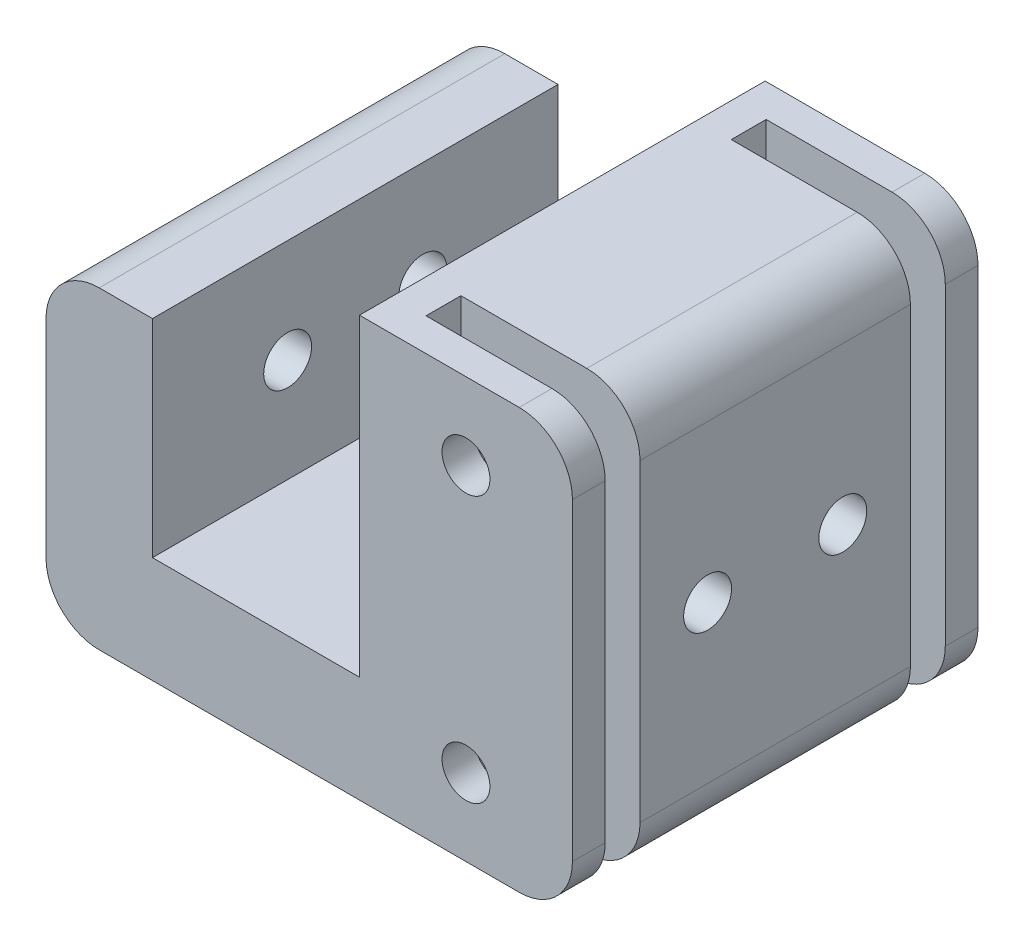
ISO-10303-21;
HEADER;
FILE_DESCRIPTION(('STEP AP214'),'2;1');
FILE_NAME('part.step','',(''),(''),'','','');
FILE_SCHEMA(('AUTOMOTIVE_DESIGN { 1 0 10303 214 1 1 1 1 }'));
ENDSEC;
DATA;
#1=APPLICATION_CONTEXT('core data for automotive mechanical design processes');
#2=APPLICATION_PROTOCOL_DEFINITION('international standard','automotive_design',2000,#1);
#3=PRODUCT_CONTEXT('',#1,'mechanical');
#4=PRODUCT('Part','Part','',(#3));
#5=PRODUCT_RELATED_PRODUCT_CATEGORY('part','',(#4));
#6=PRODUCT_DEFINITION_FORMATION('','',#4);
#7=PRODUCT_DEFINITION_CONTEXT('part definition',#1,'design');
#8=PRODUCT_DEFINITION('design','',#6,#7);
#9=PRODUCT_DEFINITION_SHAPE('','',#8);
#10=(LENGTH_UNIT() NAMED_UNIT(*) SI_UNIT(.MILLI.,.METRE.));
#11=(NAMED_UNIT(*) PLANE_ANGLE_UNIT() SI_UNIT($,.RADIAN.));
#12=(NAMED_UNIT(*) SI_UNIT($,.STERADIAN.) SOLID_ANGLE_UNIT());
#13=UNCERTAINTY_MEASURE_WITH_UNIT(LENGTH_MEASURE(1.E-05),#10,'distance_accuracy_value','');
#14=(GEOMETRIC_REPRESENTATION_CONTEXT(3) GLOBAL_UNCERTAINTY_ASSIGNED_CONTEXT((#13)) GLOBAL_UNIT_ASSIGNED_CONTEXT((#10,
#11,#12)) REPRESENTATION_CONTEXT('',''));
#15=CARTESIAN_POINT('',(0.,0.,0.));
#16=DIRECTION('',(0.,0.,1.));
#17=DIRECTION('',(1.,0.,0.));
#18=AXIS2_PLACEMENT_3D('',#15,#16,#17);
#19=CARTESIAN_POINT('',(24.725,-14.725,19.05));
#20=DIRECTION('',(0.,0.,-1.));
#21=DIRECTION('',(-1.,0.,0.));
#22=AXIS2_PLACEMENT_3D('',#19,#20,#21);
#23=CYLINDRICAL_SURFACE('',#22,5.);
#24=DIRECTION('',(0.,0.,-1.));
#25=VECTOR('',#24,1.);
#26=CARTESIAN_POINT('',(24.725,-19.725,19.05));
#27=LINE('',#26,#25);
#28=CARTESIAN_POINT('',(24.725,-19.725,12.7));
#29=VERTEX_POINT('',#28);
#30=CARTESIAN_POINT('',(24.725,-19.725,-12.7));
#31=VERTEX_POINT('',#30);
#32=EDGE_CURVE('E389',#29,#31,#27,.T.);
#33=ORIENTED_EDGE('',*,*,#32,.T.);
#34=CARTESIAN_POINT('',(24.725,-14.725,-12.7));
#35=DIRECTION('',(0.,0.,1.));
#36=DIRECTION('',(1.,0.,0.));
#37=AXIS2_PLACEMENT_3D('',#34,#35,#36);
#38=CIRCLE('',#37,5.);
#39=CARTESIAN_POINT('',(29.725,-14.725,-12.7));
#40=VERTEX_POINT('',#39);
#41=EDGE_CURVE('E298',#31,#40,#38,.T.);
#42=ORIENTED_EDGE('',*,*,#41,.T.);
#43=DIRECTION('',(0.,0.,-1.));
#44=VECTOR('',#43,1.);
#45=CARTESIAN_POINT('',(29.725,-14.725,19.05));
#46=LINE('',#45,#44);
#47=CARTESIAN_POINT('',(29.725,-14.725,12.7));
#48=VERTEX_POINT('',#47);
#49=EDGE_CURVE('E384',#48,#40,#46,.T.);
#50=ORIENTED_EDGE('',*,*,#49,.F.);
#51=CARTESIAN_POINT('',(24.725,-14.725,12.7));
#52=DIRECTION('',(0.,0.,-1.));
#53=DIRECTION('',(-1.,0.,0.));
#54=AXIS2_PLACEMENT_3D('',#51,#52,#53);
#55=CIRCLE('',#54,5.);
#56=EDGE_CURVE('E271',#48,#29,#55,.T.);
#57=ORIENTED_EDGE('',*,*,#56,.T.);
#58=EDGE_LOOP('',(#33,#42,#50,#57));
#59=FACE_BOUND('',#58,.T.);
#60=ADVANCED_FACE('F41',(#59),#23,.T.);
#61=CARTESIAN_POINT('',(24.725,-19.725,19.05));
#62=VERTEX_POINT('',#61);
#63=CARTESIAN_POINT('',(24.725,-19.725,15.975));
#64=VERTEX_POINT('',#63);
#65=EDGE_CURVE('E385',#62,#64,#27,.T.);
#66=ORIENTED_EDGE('',*,*,#65,.T.);
#67=CARTESIAN_POINT('',(24.725,-14.725,15.975));
#68=DIRECTION('',(0.,0.,1.));
#69=DIRECTION('',(1.,0.,0.));
#70=AXIS2_PLACEMENT_3D('',#67,#68,#69);
#71=CIRCLE('',#70,5.);
#72=CARTESIAN_POINT('',(29.725,-14.725,15.975));
#73=VERTEX_POINT('',#72);
#74=EDGE_CURVE('E281',#64,#73,#71,.T.);
#75=ORIENTED_EDGE('',*,*,#74,.T.);
#76=CARTESIAN_POINT('',(29.725,-14.725,19.05));
#77=VERTEX_POINT('',#76);
#78=EDGE_CURVE('E380',#77,#73,#46,.T.);
#79=ORIENTED_EDGE('',*,*,#78,.F.);
#80=CARTESIAN_POINT('',(24.725,-14.725,19.05));
#81=DIRECTION('',(0.,0.,1.));
#82=DIRECTION('',(1.,0.,0.));
#83=AXIS2_PLACEMENT_3D('',#80,#81,#82);
#84=CIRCLE('',#83,5.);
#85=EDGE_CURVE('E331',#62,#77,#84,.T.);
#86=ORIENTED_EDGE('',*,*,#85,.F.);
#87=EDGE_LOOP('',(#66,#75,#79,#86));
#88=FACE_BOUND('',#87,.T.);
#89=ADVANCED_FACE('F440',(#88),#23,.T.);
#90=CARTESIAN_POINT('',(29.725,-14.725,19.05));
#91=DIRECTION('',(-1.,0.,0.));
#92=DIRECTION('',(0.,0.,1.));
#93=AXIS2_PLACEMENT_3D('',#90,#91,#92);
#94=PLANE('',#93);
#95=CARTESIAN_POINT('',(29.725,0.,6.35));
#96=DIRECTION('',(1.,0.,0.));
#97=DIRECTION('',(0.,0.,-1.));
#98=AXIS2_PLACEMENT_3D('',#95,#96,#97);
#99=CIRCLE('',#98,2.25);
#100=CARTESIAN_POINT('',(29.725,0.,4.1));
#101=VERTEX_POINT('',#100);
#102=EDGE_CURVE('E722',#101,#101,#99,.T.);
#103=ORIENTED_EDGE('',*,*,#102,.F.);
#104=EDGE_LOOP('',(#103));
#105=FACE_BOUND('',#104,.T.);
#106=CARTESIAN_POINT('',(29.725,0.,-6.35));
#107=DIRECTION('',(1.,0.,0.));
#108=DIRECTION('',(0.,0.,-1.));
#109=AXIS2_PLACEMENT_3D('',#106,#107,#108);
#110=CIRCLE('',#109,2.25);
#111=CARTESIAN_POINT('',(29.725,0.,-8.6));
#112=VERTEX_POINT('',#111);
#113=EDGE_CURVE('E736',#112,#112,#110,.T.);
#114=ORIENTED_EDGE('',*,*,#113,.F.);
#115=EDGE_LOOP('',(#114));
#116=FACE_BOUND('',#115,.T.);
#117=ORIENTED_EDGE('',*,*,#49,.T.);
#118=DIRECTION('',(0.,1.,0.));
#119=VECTOR('',#118,1.);
#120=CARTESIAN_POINT('',(29.725,-19.725,-12.7));
#121=LINE('',#120,#119);
#122=CARTESIAN_POINT('',(29.725,14.725,-12.7));
#123=VERTEX_POINT('',#122);
#124=EDGE_CURVE('E235',#40,#123,#121,.T.);
#125=ORIENTED_EDGE('',*,*,#124,.T.);
#126=DIRECTION('',(0.,0.,-1.));
#127=VECTOR('',#126,1.);
#128=CARTESIAN_POINT('',(29.725,14.725,19.05));
#129=LINE('',#128,#127);
#130=CARTESIAN_POINT('',(29.725,14.725,12.7));
#131=VERTEX_POINT('',#130);
#132=EDGE_CURVE('E379',#131,#123,#129,.T.);
#133=ORIENTED_EDGE('',*,*,#132,.F.);
#134=DIRECTION('',(0.,1.,0.));
#135=VECTOR('',#134,1.);
#136=CARTESIAN_POINT('',(29.725,-19.725,12.7));
#137=LINE('',#136,#135);
#138=EDGE_CURVE('E241',#48,#131,#137,.T.);
#139=ORIENTED_EDGE('',*,*,#138,.F.);
#140=EDGE_LOOP('',(#117,#125,#133,#139));
#141=FACE_BOUND('',#140,.T.);
#142=ADVANCED_FACE('F448',(#105,#116,#141),#94,.F.);
#143=ORIENTED_EDGE('',*,*,#78,.T.);
#144=DIRECTION('',(0.,1.,0.));
#145=VECTOR('',#144,1.);
#146=CARTESIAN_POINT('',(29.725,-19.725,15.975));
#147=LINE('',#146,#145);
#148=CARTESIAN_POINT('',(29.725,14.725,15.975));
#149=VERTEX_POINT('',#148);
#150=EDGE_CURVE('E249',#73,#149,#147,.T.);
#151=ORIENTED_EDGE('',*,*,#150,.T.);
#152=CARTESIAN_POINT('',(29.725,14.725,19.05));
#153=VERTEX_POINT('',#152);
#154=EDGE_CURVE('E375',#153,#149,#129,.T.);
#155=ORIENTED_EDGE('',*,*,#154,.F.);
#156=DIRECTION('',(0.,1.,0.));
#157=VECTOR('',#156,1.);
#158=CARTESIAN_POINT('',(29.725,-14.725,19.05));
#159=LINE('',#158,#157);
#160=EDGE_CURVE('E333',#77,#153,#159,.T.);
#161=ORIENTED_EDGE('',*,*,#160,.F.);
#162=EDGE_LOOP('',(#143,#151,#155,#161));
#163=FACE_BOUND('',#162,.T.);
#164=ADVANCED_FACE('F463',(#163),#94,.F.);
#165=CARTESIAN_POINT('',(24.725,14.725,19.05));
#166=DIRECTION('',(0.,0.,-1.));
#167=DIRECTION('',(-1.,0.,0.));
#168=AXIS2_PLACEMENT_3D('',#165,#166,#167);
#169=CYLINDRICAL_SURFACE('',#168,5.);
#170=ORIENTED_EDGE('',*,*,#132,.T.);
#171=CARTESIAN_POINT('',(24.725,14.725,-12.7));
#172=DIRECTION('',(0.,0.,1.));
#173=DIRECTION('',(1.,0.,0.));
#174=AXIS2_PLACEMENT_3D('',#171,#172,#173);
#175=CIRCLE('',#174,5.);
#176=CARTESIAN_POINT('',(24.725,19.725,-12.7));
#177=VERTEX_POINT('',#176);
#178=EDGE_CURVE('E295',#123,#177,#175,.T.);
#179=ORIENTED_EDGE('',*,*,#178,.T.);
#180=DIRECTION('',(0.,0.,-1.));
#181=VECTOR('',#180,1.);
#182=CARTESIAN_POINT('',(24.725,19.725,19.05));
#183=LINE('',#182,#181);
#184=CARTESIAN_POINT('',(24.725,19.725,12.7));
#185=VERTEX_POINT('',#184);
#186=EDGE_CURVE('E374',#185,#177,#183,.T.);
#187=ORIENTED_EDGE('',*,*,#186,.F.);
#188=CARTESIAN_POINT('',(24.725,14.725,12.7));
#189=DIRECTION('',(0.,0.,-1.));
#190=DIRECTION('',(-1.,0.,0.));
#191=AXIS2_PLACEMENT_3D('',#188,#189,#190);
#192=CIRCLE('',#191,5.);
#193=EDGE_CURVE('E66',#185,#131,#192,.T.);
#194=ORIENTED_EDGE('',*,*,#193,.T.);
#195=EDGE_LOOP('',(#170,#179,#187,#194));
#196=FACE_BOUND('',#195,.T.);
#197=ADVANCED_FACE('F485',(#196),#169,.T.);
#198=ORIENTED_EDGE('',*,*,#154,.T.);
#199=CARTESIAN_POINT('',(24.725,14.725,15.975));
#200=DIRECTION('',(0.,0.,1.));
#201=DIRECTION('',(1.,0.,0.));
#202=AXIS2_PLACEMENT_3D('',#199,#200,#201);
#203=CIRCLE('',#202,5.);
#204=CARTESIAN_POINT('',(24.725,19.725,15.975));
#205=VERTEX_POINT('',#204);
#206=EDGE_CURVE('E278',#149,#205,#203,.T.);
#207=ORIENTED_EDGE('',*,*,#206,.T.);
#208=CARTESIAN_POINT('',(24.725,19.725,19.05));
#209=VERTEX_POINT('',#208);
#210=EDGE_CURVE('E370',#209,#205,#183,.T.);
#211=ORIENTED_EDGE('',*,*,#210,.F.);
#212=CARTESIAN_POINT('',(24.725,14.725,19.05));
#213=DIRECTION('',(0.,0.,1.));
#214=DIRECTION('',(-1.,0.,0.));
#215=AXIS2_PLACEMENT_3D('',#212,#213,#214);
#216=CIRCLE('',#215,5.);
#217=EDGE_CURVE('E335',#153,#209,#216,.T.);
#218=ORIENTED_EDGE('',*,*,#217,.F.);
#219=EDGE_LOOP('',(#198,#207,#211,#218));
#220=FACE_BOUND('',#219,.T.);
#221=ADVANCED_FACE('F506',(#220),#169,.T.);
#222=CARTESIAN_POINT('',(19.725,12.5,19.05));
#223=DIRECTION('',(0.,0.,-1.));
#224=DIRECTION('',(-1.,0.,0.));
#225=AXIS2_PLACEMENT_3D('',#222,#223,#224);
#226=CYLINDRICAL_SURFACE('',#225,2.25);
#227=CARTESIAN_POINT('',(19.725,12.5,15.975));
#228=DIRECTION('',(0.,0.,1.));
#229=DIRECTION('',(1.,0.,0.));
#230=AXIS2_PLACEMENT_3D('',#227,#228,#229);
#231=CIRCLE('',#230,2.25);
#232=CARTESIAN_POINT('',(21.975,12.5,15.975));
#233=VERTEX_POINT('',#232);
#234=EDGE_CURVE('E275',#233,#233,#231,.T.);
#235=ORIENTED_EDGE('',*,*,#234,.F.);
#236=EDGE_LOOP('',(#235));
#237=FACE_BOUND('',#236,.T.);
#238=CARTESIAN_POINT('',(19.725,12.5,19.05));
#239=DIRECTION('',(0.,0.,1.));
#240=DIRECTION('',(1.,0.,0.));
#241=AXIS2_PLACEMENT_3D('',#238,#239,#240);
#242=CIRCLE('',#241,2.25);
#243=CARTESIAN_POINT('',(21.975,12.5,19.05));
#244=VERTEX_POINT('',#243);
#245=EDGE_CURVE('E308',#244,#244,#242,.T.);
#246=ORIENTED_EDGE('',*,*,#245,.T.);
#247=EDGE_LOOP('',(#246));
#248=FACE_BOUND('',#247,.T.);
#249=ADVANCED_FACE('F537',(#237,#248),#226,.F.);
#250=CARTESIAN_POINT('',(19.725,-12.5,19.05));
#251=DIRECTION('',(0.,0.,-1.));
#252=DIRECTION('',(-1.,0.,0.));
#253=AXIS2_PLACEMENT_3D('',#250,#251,#252);
#254=CYLINDRICAL_SURFACE('',#253,2.25);
#255=CARTESIAN_POINT('',(19.725,-12.5,15.975));
#256=DIRECTION('',(0.,0.,1.));
#257=DIRECTION('',(1.,0.,0.));
#258=AXIS2_PLACEMENT_3D('',#255,#256,#257);
#259=CIRCLE('',#258,2.25);
#260=CARTESIAN_POINT('',(21.975,-12.5,15.975));
#261=VERTEX_POINT('',#260);
#262=EDGE_CURVE('E274',#261,#261,#259,.T.);
#263=ORIENTED_EDGE('',*,*,#262,.F.);
#264=EDGE_LOOP('',(#263));
#265=FACE_BOUND('',#264,.T.);
#266=CARTESIAN_POINT('',(19.725,-12.5,19.05));
#267=DIRECTION('',(0.,0.,1.));
#268=DIRECTION('',(1.,0.,0.));
#269=AXIS2_PLACEMENT_3D('',#266,#267,#268);
#270=CIRCLE('',#269,2.25);
#271=CARTESIAN_POINT('',(21.975,-12.5,19.05));
#272=VERTEX_POINT('',#271);
#273=EDGE_CURVE('E302',#272,#272,#270,.T.);
#274=ORIENTED_EDGE('',*,*,#273,.T.);
#275=EDGE_LOOP('',(#274));
#276=FACE_BOUND('',#275,.T.);
#277=ADVANCED_FACE('F420',(#265,#276),#254,.F.);
#278=CARTESIAN_POINT('',(24.725,14.725,19.05));
#279=DIRECTION('',(0.,0.,-1.));
#280=DIRECTION('',(-1.,0.,0.));
#281=AXIS2_PLACEMENT_3D('',#278,#279,#280);
#282=PLANE('',#281);
#283=DIRECTION('',(0.,-1.,0.));
#284=VECTOR('',#283,1.);
#285=CARTESIAN_POINT('',(9.725,9.725,19.05));
#286=LINE('',#285,#284);
#287=CARTESIAN_POINT('',(9.725,19.725,19.05));
#288=VERTEX_POINT('',#287);
#289=CARTESIAN_POINT('',(9.725,-9.725,19.05));
#290=VERTEX_POINT('',#289);
#291=EDGE_CURVE('E314',#288,#290,#286,.T.);
#292=ORIENTED_EDGE('',*,*,#291,.T.);
#293=DIRECTION('',(-1.,0.,0.));
#294=VECTOR('',#293,1.);
#295=CARTESIAN_POINT('',(-9.725,-9.725,19.05));
#296=LINE('',#295,#294);
#297=CARTESIAN_POINT('',(-9.725,-9.725,19.05));
#298=VERTEX_POINT('',#297);
#299=EDGE_CURVE('E316',#290,#298,#296,.T.);
#300=ORIENTED_EDGE('',*,*,#299,.T.);
#301=DIRECTION('',(0.,1.,0.));
#302=VECTOR('',#301,1.);
#303=CARTESIAN_POINT('',(-9.725,-9.725,19.05));
#304=LINE('',#303,#302);
#305=CARTESIAN_POINT('',(-9.725,9.725,19.05));
#306=VERTEX_POINT('',#305);
#307=EDGE_CURVE('E319',#298,#306,#304,.T.);
#308=ORIENTED_EDGE('',*,*,#307,.T.);
#309=DIRECTION('',(-1.,0.,0.));
#310=VECTOR('',#309,1.);
#311=CARTESIAN_POINT('',(-9.725,9.725,19.05));
#312=LINE('',#311,#310);
#313=CARTESIAN_POINT('',(-14.725,9.725,19.05));
#314=VERTEX_POINT('',#313);
#315=EDGE_CURVE('E321',#306,#314,#312,.T.);
#316=ORIENTED_EDGE('',*,*,#315,.T.);
#317=CARTESIAN_POINT('',(-14.725,4.725,19.05));
#318=DIRECTION('',(0.,0.,1.));
#319=DIRECTION('',(1.,0.,0.));
#320=AXIS2_PLACEMENT_3D('',#317,#318,#319);
#321=CIRCLE('',#320,5.);
#322=CARTESIAN_POINT('',(-19.725,4.725,19.05));
#323=VERTEX_POINT('',#322);
#324=EDGE_CURVE('E323',#314,#323,#321,.T.);
#325=ORIENTED_EDGE('',*,*,#324,.T.);
#326=DIRECTION('',(0.,-1.,0.));
#327=VECTOR('',#326,1.);
#328=CARTESIAN_POINT('',(-19.725,4.725,19.05));
#329=LINE('',#328,#327);
#330=CARTESIAN_POINT('',(-19.725,-14.725,19.05));
#331=VERTEX_POINT('',#330);
#332=EDGE_CURVE('E325',#323,#331,#329,.T.);
#333=ORIENTED_EDGE('',*,*,#332,.T.);
#334=CARTESIAN_POINT('',(-14.725,-14.725,19.05));
#335=DIRECTION('',(0.,0.,1.));
#336=DIRECTION('',(1.,0.,0.));
#337=AXIS2_PLACEMENT_3D('',#334,#335,#336);
#338=CIRCLE('',#337,5.);
#339=CARTESIAN_POINT('',(-14.725,-19.725,19.05));
#340=VERTEX_POINT('',#339);
#341=EDGE_CURVE('E327',#331,#340,#338,.T.);
#342=ORIENTED_EDGE('',*,*,#341,.T.);
#343=DIRECTION('',(1.,0.,0.));
#344=VECTOR('',#343,1.);
#345=CARTESIAN_POINT('',(-14.725,-19.725,19.05));
#346=LINE('',#345,#344);
#347=EDGE_CURVE('E329',#340,#62,#346,.T.);
#348=ORIENTED_EDGE('',*,*,#347,.T.);
#349=ORIENTED_EDGE('',*,*,#85,.T.);
#350=ORIENTED_EDGE('',*,*,#160,.T.);
#351=ORIENTED_EDGE('',*,*,#217,.T.);
#352=DIRECTION('',(-1.,0.,0.));
#353=VECTOR('',#352,1.);
#354=CARTESIAN_POINT('',(9.725,19.725,19.05));
#355=LINE('',#354,#353);
#356=EDGE_CURVE('E337',#209,#288,#355,.T.);
#357=ORIENTED_EDGE('',*,*,#356,.T.);
#358=EDGE_LOOP('',(#292,#300,#308,#316,#325,#333,#342,#348,#349,#350,#351,#357));
#359=FACE_BOUND('',#358,.T.);
#360=ORIENTED_EDGE('',*,*,#245,.F.);
#361=EDGE_LOOP('',(#360));
#362=FACE_BOUND('',#361,.T.);
#363=ORIENTED_EDGE('',*,*,#273,.F.);
#364=EDGE_LOOP('',(#363));
#365=FACE_BOUND('',#364,.T.);
#366=ADVANCED_FACE('F425',(#359,#362,#365),#282,.F.);
#367=CARTESIAN_POINT('',(24.725,14.725,-19.05));
#368=DIRECTION('',(0.,0.,-1.));
#369=DIRECTION('',(-1.,0.,0.));
#370=AXIS2_PLACEMENT_3D('',#367,#368,#369);
#371=PLANE('',#370);
#372=CARTESIAN_POINT('',(19.725,12.5,-19.05));
#373=DIRECTION('',(0.,0.,1.));
#374=DIRECTION('',(1.,0.,0.));
#375=AXIS2_PLACEMENT_3D('',#372,#373,#374);
#376=CIRCLE('',#375,2.25);
#377=CARTESIAN_POINT('',(21.975,12.5,-19.05));
#378=VERTEX_POINT('',#377);
#379=EDGE_CURVE('E305',#378,#378,#376,.T.);
#380=ORIENTED_EDGE('',*,*,#379,.T.);
#381=EDGE_LOOP('',(#380));
#382=FACE_BOUND('',#381,.T.);
#383=DIRECTION('',(0.,-1.,0.));
#384=VECTOR('',#383,1.);
#385=CARTESIAN_POINT('',(9.725,-9.725,-19.05));
#386=LINE('',#385,#384);
#387=CARTESIAN_POINT('',(9.725,19.725,-19.05));
#388=VERTEX_POINT('',#387);
#389=CARTESIAN_POINT('',(9.725,-9.725,-19.05));
#390=VERTEX_POINT('',#389);
#391=EDGE_CURVE('E311',#388,#390,#386,.T.);
#392=ORIENTED_EDGE('',*,*,#391,.F.);
#393=DIRECTION('',(-1.,0.,0.));
#394=VECTOR('',#393,1.);
#395=CARTESIAN_POINT('',(9.725,19.725,-19.05));
#396=LINE('',#395,#394);
#397=CARTESIAN_POINT('',(24.725,19.725,-19.05));
#398=VERTEX_POINT('',#397);
#399=EDGE_CURVE('E317',#398,#388,#396,.T.);
#400=ORIENTED_EDGE('',*,*,#399,.F.);
#401=CARTESIAN_POINT('',(24.725,14.725,-19.05));
#402=DIRECTION('',(0.,0.,1.));
#403=DIRECTION('',(-1.,0.,0.));
#404=AXIS2_PLACEMENT_3D('',#401,#402,#403);
#405=CIRCLE('',#404,5.);
#406=CARTESIAN_POINT('',(29.725,14.725,-19.05));
#407=VERTEX_POINT('',#406);
#408=EDGE_CURVE('E362',#407,#398,#405,.T.);
#409=ORIENTED_EDGE('',*,*,#408,.F.);
#410=DIRECTION('',(0.,1.,0.));
#411=VECTOR('',#410,1.);
#412=CARTESIAN_POINT('',(29.725,-14.725,-19.05));
#413=LINE('',#412,#411);
#414=CARTESIAN_POINT('',(29.725,-14.725,-19.05));
#415=VERTEX_POINT('',#414);
#416=EDGE_CURVE('E359',#415,#407,#413,.T.);
#417=ORIENTED_EDGE('',*,*,#416,.F.);
#418=CARTESIAN_POINT('',(24.725,-14.725,-19.05));
#419=DIRECTION('',(0.,0.,1.));
#420=DIRECTION('',(1.,0.,0.));
#421=AXIS2_PLACEMENT_3D('',#418,#419,#420);
#422=CIRCLE('',#421,5.);
#423=CARTESIAN_POINT('',(24.725,-19.725,-19.05));
#424=VERTEX_POINT('',#423);
#425=EDGE_CURVE('E356',#424,#415,#422,.T.);
#426=ORIENTED_EDGE('',*,*,#425,.F.);
#427=DIRECTION('',(1.,0.,0.));
#428=VECTOR('',#427,1.);
#429=CARTESIAN_POINT('',(-14.725,-19.725,-19.05));
#430=LINE('',#429,#428);
#431=CARTESIAN_POINT('',(-14.725,-19.725,-19.05));
#432=VERTEX_POINT('',#431);
#433=EDGE_CURVE('E353',#432,#424,#430,.T.);
#434=ORIENTED_EDGE('',*,*,#433,.F.);
#435=CARTESIAN_POINT('',(-14.725,-14.725,-19.05));
#436=DIRECTION('',(0.,0.,1.));
#437=DIRECTION('',(1.,0.,0.));
#438=AXIS2_PLACEMENT_3D('',#435,#436,#437);
#439=CIRCLE('',#438,5.);
#440=CARTESIAN_POINT('',(-19.725,-14.725,-19.05));
#441=VERTEX_POINT('',#440);
#442=EDGE_CURVE('E351',#441,#432,#439,.T.);
#443=ORIENTED_EDGE('',*,*,#442,.F.);
#444=DIRECTION('',(0.,-1.,0.));
#445=VECTOR('',#444,1.);
#446=CARTESIAN_POINT('',(-19.725,4.725,-19.05));
#447=LINE('',#446,#445);
#448=CARTESIAN_POINT('',(-19.725,4.725,-19.05));
#449=VERTEX_POINT('',#448);
#450=EDGE_CURVE('E349',#449,#441,#447,.T.);
#451=ORIENTED_EDGE('',*,*,#450,.F.);
#452=CARTESIAN_POINT('',(-14.725,4.725,-19.05));
#453=DIRECTION('',(0.,0.,1.));
#454=DIRECTION('',(1.,0.,0.));
#455=AXIS2_PLACEMENT_3D('',#452,#453,#454);
#456=CIRCLE('',#455,5.);
#457=CARTESIAN_POINT('',(-14.725,9.725,-19.05));
#458=VERTEX_POINT('',#457);
#459=EDGE_CURVE('E347',#458,#449,#456,.T.);
#460=ORIENTED_EDGE('',*,*,#459,.F.);
#461=DIRECTION('',(-1.,0.,0.));
#462=VECTOR('',#461,1.);
#463=CARTESIAN_POINT('',(-9.725,9.725,-19.05));
#464=LINE('',#463,#462);
#465=CARTESIAN_POINT('',(-9.725,9.725,-19.05));
#466=VERTEX_POINT('',#465);
#467=EDGE_CURVE('E345',#466,#458,#464,.T.);
#468=ORIENTED_EDGE('',*,*,#467,.F.);
#469=DIRECTION('',(0.,1.,0.));
#470=VECTOR('',#469,1.);
#471=CARTESIAN_POINT('',(-9.725,-9.725,-19.05));
#472=LINE('',#471,#470);
#473=CARTESIAN_POINT('',(-9.725,-9.725,-19.05));
#474=VERTEX_POINT('',#473);
#475=EDGE_CURVE('E343',#474,#466,#472,.T.);
#476=ORIENTED_EDGE('',*,*,#475,.F.);
#477=DIRECTION('',(-1.,0.,0.));
#478=VECTOR('',#477,1.);
#479=CARTESIAN_POINT('',(-9.725,-9.725,-19.05));
#480=LINE('',#479,#478);
#481=EDGE_CURVE('E341',#390,#474,#480,.T.);
#482=ORIENTED_EDGE('',*,*,#481,.F.);
#483=EDGE_LOOP('',(#392,#400,#409,#417,#426,#434,#443,#451,#460,#468,#476,#482));
#484=FACE_BOUND('',#483,.T.);
#485=CARTESIAN_POINT('',(19.725,-12.5,-19.05));
#486=DIRECTION('',(0.,0.,1.));
#487=DIRECTION('',(1.,0.,0.));
#488=AXIS2_PLACEMENT_3D('',#485,#486,#487);
#489=CIRCLE('',#488,2.25);
#490=CARTESIAN_POINT('',(21.975,-12.5,-19.05));
#491=VERTEX_POINT('',#490);
#492=EDGE_CURVE('E301',#491,#491,#489,.T.);
#493=ORIENTED_EDGE('',*,*,#492,.T.);
#494=EDGE_LOOP('',(#493));
#495=FACE_BOUND('',#494,.T.);
#496=ADVANCED_FACE('F423',(#382,#484,#495),#371,.T.);
#497=CARTESIAN_POINT('',(9.725,-9.725,19.05));
#498=DIRECTION('',(1.,0.,0.));
#499=DIRECTION('',(0.,0.,-1.));
#500=AXIS2_PLACEMENT_3D('',#497,#498,#499);
#501=PLANE('',#500);
#502=CARTESIAN_POINT('',(9.725,0.,6.35));
#503=DIRECTION('',(1.,0.,0.));
#504=DIRECTION('',(0.,0.,-1.));
#505=AXIS2_PLACEMENT_3D('',#502,#503,#504);
#506=CIRCLE('',#505,2.25);
#507=CARTESIAN_POINT('',(9.725,0.,4.1));
#508=VERTEX_POINT('',#507);
#509=EDGE_CURVE('E252',#508,#508,#506,.T.);
#510=ORIENTED_EDGE('',*,*,#509,.T.);
#511=EDGE_LOOP('',(#510));
#512=FACE_BOUND('',#511,.T.);
#513=CARTESIAN_POINT('',(9.725,0.,-6.35));
#514=DIRECTION('',(1.,0.,0.));
#515=DIRECTION('',(0.,0.,-1.));
#516=AXIS2_PLACEMENT_3D('',#513,#514,#515);
#517=CIRCLE('',#516,2.25);
#518=CARTESIAN_POINT('',(9.725,0.,-8.6));
#519=VERTEX_POINT('',#518);
#520=EDGE_CURVE('E727',#519,#519,#517,.T.);
#521=ORIENTED_EDGE('',*,*,#520,.T.);
#522=EDGE_LOOP('',(#521));
#523=FACE_BOUND('',#522,.T.);
#524=ORIENTED_EDGE('',*,*,#391,.T.);
#525=DIRECTION('',(0.,0.,-1.));
#526=VECTOR('',#525,1.);
#527=CARTESIAN_POINT('',(9.725,-9.725,19.05));
#528=LINE('',#527,#526);
#529=EDGE_CURVE('E11',#290,#390,#528,.T.);
#530=ORIENTED_EDGE('',*,*,#529,.F.);
#531=ORIENTED_EDGE('',*,*,#291,.F.);
#532=DIRECTION('',(0.,0.,-1.));
#533=VECTOR('',#532,1.);
#534=CARTESIAN_POINT('',(9.725,19.725,19.05));
#535=LINE('',#534,#533);
#536=EDGE_CURVE('E339',#288,#388,#535,.T.);
#537=ORIENTED_EDGE('',*,*,#536,.T.);
#538=EDGE_LOOP('',(#524,#530,#531,#537));
#539=FACE_BOUND('',#538,.T.);
#540=ADVANCED_FACE('F43',(#512,#523,#539),#501,.F.);
#541=CARTESIAN_POINT('',(-9.725,-9.725,19.05));
#542=DIRECTION('',(0.,-1.,0.));
#543=DIRECTION('',(0.,0.,-1.));
#544=AXIS2_PLACEMENT_3D('',#541,#542,#543);
#545=PLANE('',#544);
#546=ORIENTED_EDGE('',*,*,#481,.T.);
#547=DIRECTION('',(0.,0.,-1.));
#548=VECTOR('',#547,1.);
#549=CARTESIAN_POINT('',(-9.725,-9.725,19.05));
#550=LINE('',#549,#548);
#551=EDGE_CURVE('E50',#298,#474,#550,.T.);
#552=ORIENTED_EDGE('',*,*,#551,.F.);
#553=ORIENTED_EDGE('',*,*,#299,.F.);
#554=ORIENTED_EDGE('',*,*,#529,.T.);
#555=EDGE_LOOP('',(#546,#552,#553,#554));
#556=FACE_BOUND('',#555,.T.);
#557=ADVANCED_FACE('F433',(#556),#545,.F.);
#558=CARTESIAN_POINT('',(-9.725,-9.725,19.05));
#559=DIRECTION('',(-1.,0.,0.));
#560=DIRECTION('',(0.,0.,1.));
#561=AXIS2_PLACEMENT_3D('',#558,#559,#560);
#562=PLANE('',#561);
#563=CARTESIAN_POINT('',(-9.725,0.,6.35));
#564=DIRECTION('',(-1.,0.,0.));
#565=DIRECTION('',(0.,0.,1.));
#566=AXIS2_PLACEMENT_3D('',#563,#564,#565);
#567=CIRCLE('',#566,2.25);
#568=CARTESIAN_POINT('',(-9.725,0.,8.6));
#569=VERTEX_POINT('',#568);
#570=EDGE_CURVE('E725',#569,#569,#567,.T.);
#571=ORIENTED_EDGE('',*,*,#570,.T.);
#572=EDGE_LOOP('',(#571));
#573=FACE_BOUND('',#572,.T.);
#574=CARTESIAN_POINT('',(-9.725,0.,-6.35));
#575=DIRECTION('',(-1.,0.,0.));
#576=DIRECTION('',(0.,0.,1.));
#577=AXIS2_PLACEMENT_3D('',#574,#575,#576);
#578=CIRCLE('',#577,2.25);
#579=CARTESIAN_POINT('',(-9.725,0.,-4.1));
#580=VERTEX_POINT('',#579);
#581=EDGE_CURVE('E732',#580,#580,#578,.T.);
#582=ORIENTED_EDGE('',*,*,#581,.T.);
#583=EDGE_LOOP('',(#582));
#584=FACE_BOUND('',#583,.T.);
#585=ORIENTED_EDGE('',*,*,#475,.T.);
#586=DIRECTION('',(0.,0.,-1.));
#587=VECTOR('',#586,1.);
#588=CARTESIAN_POINT('',(-9.725,9.725,19.05));
#589=LINE('',#588,#587);
#590=EDGE_CURVE('E401',#306,#466,#589,.T.);
#591=ORIENTED_EDGE('',*,*,#590,.F.);
#592=ORIENTED_EDGE('',*,*,#307,.F.);
#593=ORIENTED_EDGE('',*,*,#551,.T.);
#594=EDGE_LOOP('',(#585,#591,#592,#593));
#595=FACE_BOUND('',#594,.T.);
#596=ADVANCED_FACE('F751',(#573,#584,#595),#562,.F.);
#597=CARTESIAN_POINT('',(-9.725,9.725,19.05));
#598=DIRECTION('',(0.,-1.,0.));
#599=DIRECTION('',(0.,0.,-1.));
#600=AXIS2_PLACEMENT_3D('',#597,#598,#599);
#601=PLANE('',#600);
#602=ORIENTED_EDGE('',*,*,#467,.T.);
#603=DIRECTION('',(0.,0.,-1.));
#604=VECTOR('',#603,1.);
#605=CARTESIAN_POINT('',(-14.725,9.725,19.05));
#606=LINE('',#605,#604);
#607=EDGE_CURVE('E398',#314,#458,#606,.T.);
#608=ORIENTED_EDGE('',*,*,#607,.F.);
#609=ORIENTED_EDGE('',*,*,#315,.F.);
#610=ORIENTED_EDGE('',*,*,#590,.T.);
#611=EDGE_LOOP('',(#602,#608,#609,#610));
#612=FACE_BOUND('',#611,.T.);
#613=ADVANCED_FACE('F754',(#612),#601,.F.);
#614=CARTESIAN_POINT('',(-14.725,4.725,19.05));
#615=DIRECTION('',(0.,0.,-1.));
#616=DIRECTION('',(-1.,0.,0.));
#617=AXIS2_PLACEMENT_3D('',#614,#615,#616);
#618=CYLINDRICAL_SURFACE('',#617,5.);
#619=ORIENTED_EDGE('',*,*,#459,.T.);
#620=DIRECTION('',(0.,0.,-1.));
#621=VECTOR('',#620,1.);
#622=CARTESIAN_POINT('',(-19.725,4.725,19.05));
#623=LINE('',#622,#621);
#624=EDGE_CURVE('E395',#323,#449,#623,.T.);
#625=ORIENTED_EDGE('',*,*,#624,.F.);
#626=ORIENTED_EDGE('',*,*,#324,.F.);
#627=ORIENTED_EDGE('',*,*,#607,.T.);
#628=EDGE_LOOP('',(#619,#625,#626,#627));
#629=FACE_BOUND('',#628,.T.);
#630=ADVANCED_FACE('F767',(#629),#618,.T.);
#631=CARTESIAN_POINT('',(-19.725,4.725,19.05));
#632=DIRECTION('',(1.,0.,0.));
#633=DIRECTION('',(0.,1.,0.));
#634=AXIS2_PLACEMENT_3D('',#631,#632,#633);
#635=PLANE('',#634);
#636=CARTESIAN_POINT('',(-19.725,0.,6.35));
#637=DIRECTION('',(1.,0.,0.));
#638=DIRECTION('',(0.,0.,-1.));
#639=AXIS2_PLACEMENT_3D('',#636,#637,#638);
#640=CIRCLE('',#639,2.25);
#641=CARTESIAN_POINT('',(-19.725,0.,4.1));
#642=VERTEX_POINT('',#641);
#643=EDGE_CURVE('E735',#642,#642,#640,.T.);
#644=ORIENTED_EDGE('',*,*,#643,.T.);
#645=EDGE_LOOP('',(#644));
#646=FACE_BOUND('',#645,.T.);
#647=CARTESIAN_POINT('',(-19.725,0.,-6.35));
#648=DIRECTION('',(1.,0.,0.));
#649=DIRECTION('',(0.,0.,-1.));
#650=AXIS2_PLACEMENT_3D('',#647,#648,#649);
#651=CIRCLE('',#650,2.25);
#652=CARTESIAN_POINT('',(-19.725,0.,-8.6));
#653=VERTEX_POINT('',#652);
#654=EDGE_CURVE('E739',#653,#653,#651,.T.);
#655=ORIENTED_EDGE('',*,*,#654,.T.);
#656=EDGE_LOOP('',(#655));
#657=FACE_BOUND('',#656,.T.);
#658=ORIENTED_EDGE('',*,*,#450,.T.);
#659=DIRECTION('',(0.,0.,-1.));
#660=VECTOR('',#659,1.);
#661=CARTESIAN_POINT('',(-19.725,-14.725,19.05));
#662=LINE('',#661,#660);
#663=EDGE_CURVE('E392',#331,#441,#662,.T.);
#664=ORIENTED_EDGE('',*,*,#663,.F.);
#665=ORIENTED_EDGE('',*,*,#332,.F.);
#666=ORIENTED_EDGE('',*,*,#624,.T.);
#667=EDGE_LOOP('',(#658,#664,#665,#666));
#668=FACE_BOUND('',#667,.T.);
#669=ADVANCED_FACE('F746',(#646,#657,#668),#635,.F.);
#670=CARTESIAN_POINT('',(-14.725,-14.725,19.05));
#671=DIRECTION('',(0.,0.,-1.));
#672=DIRECTION('',(-1.,0.,0.));
#673=AXIS2_PLACEMENT_3D('',#670,#671,#672);
#674=CYLINDRICAL_SURFACE('',#673,5.);
#675=ORIENTED_EDGE('',*,*,#442,.T.);
#676=DIRECTION('',(0.,0.,-1.));
#677=VECTOR('',#676,1.);
#678=CARTESIAN_POINT('',(-14.725,-19.725,19.05));
#679=LINE('',#678,#677);
#680=EDGE_CURVE('E388',#340,#432,#679,.T.);
#681=ORIENTED_EDGE('',*,*,#680,.F.);
#682=ORIENTED_EDGE('',*,*,#341,.F.);
#683=ORIENTED_EDGE('',*,*,#663,.T.);
#684=EDGE_LOOP('',(#675,#681,#682,#683));
#685=FACE_BOUND('',#684,.T.);
#686=ADVANCED_FACE('F464',(#685),#674,.T.);
#687=CARTESIAN_POINT('',(-14.725,-19.725,19.05));
#688=DIRECTION('',(0.,1.,0.));
#689=DIRECTION('',(0.,0.,1.));
#690=AXIS2_PLACEMENT_3D('',#687,#688,#689);
#691=PLANE('',#690);
#692=DIRECTION('',(0.,0.,1.));
#693=VECTOR('',#692,1.);
#694=CARTESIAN_POINT('',(12.9,-19.725,-15.975));
#695=LINE('',#694,#693);
#696=CARTESIAN_POINT('',(12.9,-19.725,-15.975));
#697=VERTEX_POINT('',#696);
#698=CARTESIAN_POINT('',(12.9,-19.725,-12.7));
#699=VERTEX_POINT('',#698);
#700=EDGE_CURVE('E217',#697,#699,#695,.T.);
#701=ORIENTED_EDGE('',*,*,#700,.T.);
#702=DIRECTION('',(1.,0.,0.));
#703=VECTOR('',#702,1.);
#704=CARTESIAN_POINT('',(29.725,-19.725,-12.7));
#705=LINE('',#704,#703);
#706=EDGE_CURVE('E232',#699,#31,#705,.T.);
#707=ORIENTED_EDGE('',*,*,#706,.T.);
#708=ORIENTED_EDGE('',*,*,#32,.F.);
#709=DIRECTION('',(-1.,0.,0.));
#710=VECTOR('',#709,1.);
#711=CARTESIAN_POINT('',(29.725,-19.725,12.7));
#712=LINE('',#711,#710);
#713=CARTESIAN_POINT('',(12.9,-19.725,12.7));
#714=VERTEX_POINT('',#713);
#715=EDGE_CURVE('E258',#29,#714,#712,.T.);
#716=ORIENTED_EDGE('',*,*,#715,.T.);
#717=DIRECTION('',(0.,0.,1.));
#718=VECTOR('',#717,1.);
#719=CARTESIAN_POINT('',(12.9,-19.725,12.7));
#720=LINE('',#719,#718);
#721=CARTESIAN_POINT('',(12.9,-19.725,15.975));
#722=VERTEX_POINT('',#721);
#723=EDGE_CURVE('E255',#714,#722,#720,.T.);
#724=ORIENTED_EDGE('',*,*,#723,.T.);
#725=DIRECTION('',(1.,0.,0.));
#726=VECTOR('',#725,1.);
#727=CARTESIAN_POINT('',(29.725,-19.725,15.975));
#728=LINE('',#727,#726);
#729=EDGE_CURVE('E243',#722,#64,#728,.T.);
#730=ORIENTED_EDGE('',*,*,#729,.T.);
#731=ORIENTED_EDGE('',*,*,#65,.F.);
#732=ORIENTED_EDGE('',*,*,#347,.F.);
#733=ORIENTED_EDGE('',*,*,#680,.T.);
#734=ORIENTED_EDGE('',*,*,#433,.T.);
#735=CARTESIAN_POINT('',(24.725,-19.725,-15.975));
#736=VERTEX_POINT('',#735);
#737=EDGE_CURVE('E383',#736,#424,#27,.T.);
#738=ORIENTED_EDGE('',*,*,#737,.F.);
#739=DIRECTION('',(-1.,0.,0.));
#740=VECTOR('',#739,1.);
#741=CARTESIAN_POINT('',(29.725,-19.725,-15.975));
#742=LINE('',#741,#740);
#743=EDGE_CURVE('E226',#736,#697,#742,.T.);
#744=ORIENTED_EDGE('',*,*,#743,.T.);
#745=EDGE_LOOP('',(#701,#707,#708,#716,#724,#730,#731,#732,#733,#734,#738,#744));
#746=FACE_BOUND('',#745,.T.);
#747=ADVANCED_FACE('F455',(#746),#691,.F.);
#748=CARTESIAN_POINT('',(29.725,-14.725,-15.975));
#749=VERTEX_POINT('',#748);
#750=EDGE_CURVE('E378',#749,#415,#46,.T.);
#751=ORIENTED_EDGE('',*,*,#750,.F.);
#752=CARTESIAN_POINT('',(24.725,-14.725,-15.975));
#753=DIRECTION('',(0.,0.,-1.));
#754=DIRECTION('',(-1.,0.,0.));
#755=AXIS2_PLACEMENT_3D('',#752,#753,#754);
#756=CIRCLE('',#755,5.);
#757=EDGE_CURVE('E289',#749,#736,#756,.T.);
#758=ORIENTED_EDGE('',*,*,#757,.T.);
#759=ORIENTED_EDGE('',*,*,#737,.T.);
#760=ORIENTED_EDGE('',*,*,#425,.T.);
#761=EDGE_LOOP('',(#751,#758,#759,#760));
#762=FACE_BOUND('',#761,.T.);
#763=ADVANCED_FACE('F443',(#762),#23,.T.);
#764=CARTESIAN_POINT('',(29.725,14.725,-15.975));
#765=VERTEX_POINT('',#764);
#766=EDGE_CURVE('E373',#765,#407,#129,.T.);
#767=ORIENTED_EDGE('',*,*,#766,.F.);
#768=DIRECTION('',(0.,1.,0.));
#769=VECTOR('',#768,1.);
#770=CARTESIAN_POINT('',(29.725,-19.725,-15.975));
#771=LINE('',#770,#769);
#772=EDGE_CURVE('E220',#749,#765,#771,.T.);
#773=ORIENTED_EDGE('',*,*,#772,.F.);
#774=ORIENTED_EDGE('',*,*,#750,.T.);
#775=ORIENTED_EDGE('',*,*,#416,.T.);
#776=EDGE_LOOP('',(#767,#773,#774,#775));
#777=FACE_BOUND('',#776,.T.);
#778=ADVANCED_FACE('F454',(#777),#94,.F.);
#779=CARTESIAN_POINT('',(24.725,19.725,-15.975));
#780=VERTEX_POINT('',#779);
#781=EDGE_CURVE('E369',#780,#398,#183,.T.);
#782=ORIENTED_EDGE('',*,*,#781,.F.);
#783=CARTESIAN_POINT('',(24.725,14.725,-15.975));
#784=DIRECTION('',(0.,0.,-1.));
#785=DIRECTION('',(-1.,0.,0.));
#786=AXIS2_PLACEMENT_3D('',#783,#784,#785);
#787=CIRCLE('',#786,5.);
#788=EDGE_CURVE('E58',#780,#765,#787,.T.);
#789=ORIENTED_EDGE('',*,*,#788,.T.);
#790=ORIENTED_EDGE('',*,*,#766,.T.);
#791=ORIENTED_EDGE('',*,*,#408,.T.);
#792=EDGE_LOOP('',(#782,#789,#790,#791));
#793=FACE_BOUND('',#792,.T.);
#794=ADVANCED_FACE('F461',(#793),#169,.T.);
#795=CARTESIAN_POINT('',(9.725,19.725,19.05));
#796=DIRECTION('',(0.,-1.,0.));
#797=DIRECTION('',(0.,0.,-1.));
#798=AXIS2_PLACEMENT_3D('',#795,#796,#797);
#799=PLANE('',#798);
#800=ORIENTED_EDGE('',*,*,#186,.T.);
#801=DIRECTION('',(1.,0.,0.));
#802=VECTOR('',#801,1.);
#803=CARTESIAN_POINT('',(29.725,19.725,-12.7));
#804=LINE('',#803,#802);
#805=CARTESIAN_POINT('',(12.9,19.725,-12.7));
#806=VERTEX_POINT('',#805);
#807=EDGE_CURVE('E224',#806,#177,#804,.T.);
#808=ORIENTED_EDGE('',*,*,#807,.F.);
#809=DIRECTION('',(0.,0.,1.));
#810=VECTOR('',#809,1.);
#811=CARTESIAN_POINT('',(12.9,19.725,-15.975));
#812=LINE('',#811,#810);
#813=CARTESIAN_POINT('',(12.9,19.725,-15.975));
#814=VERTEX_POINT('',#813);
#815=EDGE_CURVE('E209',#814,#806,#812,.T.);
#816=ORIENTED_EDGE('',*,*,#815,.F.);
#817=DIRECTION('',(-1.,0.,0.));
#818=VECTOR('',#817,1.);
#819=CARTESIAN_POINT('',(29.725,19.725,-15.975));
#820=LINE('',#819,#818);
#821=EDGE_CURVE('E201',#780,#814,#820,.T.);
#822=ORIENTED_EDGE('',*,*,#821,.F.);
#823=ORIENTED_EDGE('',*,*,#781,.T.);
#824=ORIENTED_EDGE('',*,*,#399,.T.);
#825=ORIENTED_EDGE('',*,*,#536,.F.);
#826=ORIENTED_EDGE('',*,*,#356,.F.);
#827=ORIENTED_EDGE('',*,*,#210,.T.);
#828=DIRECTION('',(1.,0.,0.));
#829=VECTOR('',#828,1.);
#830=CARTESIAN_POINT('',(29.725,19.725,15.975));
#831=LINE('',#830,#829);
#832=CARTESIAN_POINT('',(12.9,19.725,15.975));
#833=VERTEX_POINT('',#832);
#834=EDGE_CURVE('E261',#833,#205,#831,.T.);
#835=ORIENTED_EDGE('',*,*,#834,.F.);
#836=DIRECTION('',(0.,0.,1.));
#837=VECTOR('',#836,1.);
#838=CARTESIAN_POINT('',(12.9,19.725,12.7));
#839=LINE('',#838,#837);
#840=CARTESIAN_POINT('',(12.9,19.725,12.7));
#841=VERTEX_POINT('',#840);
#842=EDGE_CURVE('E263',#841,#833,#839,.T.);
#843=ORIENTED_EDGE('',*,*,#842,.F.);
#844=DIRECTION('',(-1.,0.,0.));
#845=VECTOR('',#844,1.);
#846=CARTESIAN_POINT('',(29.725,19.725,12.7));
#847=LINE('',#846,#845);
#848=EDGE_CURVE('E210',#185,#841,#847,.T.);
#849=ORIENTED_EDGE('',*,*,#848,.F.);
#850=EDGE_LOOP('',(#800,#808,#816,#822,#823,#824,#825,#826,#827,#835,#843,#849));
#851=FACE_BOUND('',#850,.T.);
#852=ADVANCED_FACE('F223',(#851),#799,.F.);
#853=CARTESIAN_POINT('',(19.725,12.5,-15.975));
#854=DIRECTION('',(0.,0.,-1.));
#855=DIRECTION('',(-1.,0.,0.));
#856=AXIS2_PLACEMENT_3D('',#853,#854,#855);
#857=CIRCLE('',#856,2.25);
#858=CARTESIAN_POINT('',(17.475,12.5,-15.975));
#859=VERTEX_POINT('',#858);
#860=EDGE_CURVE('E285',#859,#859,#857,.T.);
#861=ORIENTED_EDGE('',*,*,#860,.F.);
#862=EDGE_LOOP('',(#861));
#863=FACE_BOUND('',#862,.T.);
#864=ORIENTED_EDGE('',*,*,#379,.F.);
#865=EDGE_LOOP('',(#864));
#866=FACE_BOUND('',#865,.T.);
#867=ADVANCED_FACE('F417',(#863,#866),#226,.F.);
#868=CARTESIAN_POINT('',(19.725,-12.5,-15.975));
#869=DIRECTION('',(0.,0.,-1.));
#870=DIRECTION('',(-1.,0.,0.));
#871=AXIS2_PLACEMENT_3D('',#868,#869,#870);
#872=CIRCLE('',#871,2.25);
#873=CARTESIAN_POINT('',(17.475,-12.5,-15.975));
#874=VERTEX_POINT('',#873);
#875=EDGE_CURVE('E284',#874,#874,#872,.T.);
#876=ORIENTED_EDGE('',*,*,#875,.F.);
#877=EDGE_LOOP('',(#876));
#878=FACE_BOUND('',#877,.T.);
#879=ORIENTED_EDGE('',*,*,#492,.F.);
#880=EDGE_LOOP('',(#879));
#881=FACE_BOUND('',#880,.T.);
#882=ADVANCED_FACE('F413',(#878,#881),#254,.F.);
#883=CARTESIAN_POINT('',(29.725,-19.725,15.975));
#884=DIRECTION('',(0.,0.,1.));
#885=DIRECTION('',(1.,0.,0.));
#886=AXIS2_PLACEMENT_3D('',#883,#884,#885);
#887=PLANE('',#886);
#888=ORIENTED_EDGE('',*,*,#234,.T.);
#889=EDGE_LOOP('',(#888));
#890=FACE_BOUND('',#889,.T.);
#891=ORIENTED_EDGE('',*,*,#262,.T.);
#892=EDGE_LOOP('',(#891));
#893=FACE_BOUND('',#892,.T.);
#894=ORIENTED_EDGE('',*,*,#729,.F.);
#895=DIRECTION('',(0.,1.,0.));
#896=VECTOR('',#895,1.);
#897=CARTESIAN_POINT('',(12.9,-19.725,15.975));
#898=LINE('',#897,#896);
#899=EDGE_CURVE('E247',#722,#833,#898,.T.);
#900=ORIENTED_EDGE('',*,*,#899,.T.);
#901=ORIENTED_EDGE('',*,*,#834,.T.);
#902=ORIENTED_EDGE('',*,*,#206,.F.);
#903=ORIENTED_EDGE('',*,*,#150,.F.);
#904=ORIENTED_EDGE('',*,*,#74,.F.);
#905=EDGE_LOOP('',(#894,#900,#901,#902,#903,#904));
#906=FACE_BOUND('',#905,.T.);
#907=ADVANCED_FACE('F416',(#890,#893,#906),#887,.F.);
#908=CARTESIAN_POINT('',(29.725,-19.725,12.7));
#909=DIRECTION('',(0.,0.,-1.));
#910=DIRECTION('',(-1.,0.,0.));
#911=AXIS2_PLACEMENT_3D('',#908,#909,#910);
#912=PLANE('',#911);
#913=CARTESIAN_POINT('',(19.725,12.5,12.7));
#914=DIRECTION('',(0.,0.,-1.));
#915=DIRECTION('',(-1.,0.,0.));
#916=AXIS2_PLACEMENT_3D('',#913,#914,#915);
#917=CIRCLE('',#916,2.25);
#918=CARTESIAN_POINT('',(17.475,12.5,12.7));
#919=VERTEX_POINT('',#918);
#920=EDGE_CURVE('E267',#919,#919,#917,.T.);
#921=ORIENTED_EDGE('',*,*,#920,.T.);
#922=EDGE_LOOP('',(#921));
#923=FACE_BOUND('',#922,.T.);
#924=CARTESIAN_POINT('',(19.725,-12.5,12.7));
#925=DIRECTION('',(0.,0.,-1.));
#926=DIRECTION('',(-1.,0.,0.));
#927=AXIS2_PLACEMENT_3D('',#924,#925,#926);
#928=CIRCLE('',#927,2.25);
#929=CARTESIAN_POINT('',(17.475,-12.5,12.7));
#930=VERTEX_POINT('',#929);
#931=EDGE_CURVE('E238',#930,#930,#928,.T.);
#932=ORIENTED_EDGE('',*,*,#931,.T.);
#933=EDGE_LOOP('',(#932));
#934=FACE_BOUND('',#933,.T.);
#935=ORIENTED_EDGE('',*,*,#138,.T.);
#936=ORIENTED_EDGE('',*,*,#193,.F.);
#937=ORIENTED_EDGE('',*,*,#848,.T.);
#938=DIRECTION('',(0.,1.,0.));
#939=VECTOR('',#938,1.);
#940=CARTESIAN_POINT('',(12.9,-19.725,12.7));
#941=LINE('',#940,#939);
#942=EDGE_CURVE('E244',#714,#841,#941,.T.);
#943=ORIENTED_EDGE('',*,*,#942,.F.);
#944=ORIENTED_EDGE('',*,*,#715,.F.);
#945=ORIENTED_EDGE('',*,*,#56,.F.);
#946=EDGE_LOOP('',(#935,#936,#937,#943,#944,#945));
#947=FACE_BOUND('',#946,.T.);
#948=ADVANCED_FACE('F519',(#923,#934,#947),#912,.F.);
#949=CARTESIAN_POINT('',(12.9,-19.725,12.7));
#950=DIRECTION('',(-1.,0.,0.));
#951=DIRECTION('',(0.,0.,1.));
#952=AXIS2_PLACEMENT_3D('',#949,#950,#951);
#953=PLANE('',#952);
#954=ORIENTED_EDGE('',*,*,#899,.F.);
#955=ORIENTED_EDGE('',*,*,#723,.F.);
#956=ORIENTED_EDGE('',*,*,#942,.T.);
#957=ORIENTED_EDGE('',*,*,#842,.T.);
#958=EDGE_LOOP('',(#954,#955,#956,#957));
#959=FACE_BOUND('',#958,.T.);
#960=ADVANCED_FACE('F518',(#959),#953,.F.);
#961=CARTESIAN_POINT('',(29.725,-19.725,-12.7));
#962=DIRECTION('',(0.,0.,1.));
#963=DIRECTION('',(1.,0.,0.));
#964=AXIS2_PLACEMENT_3D('',#961,#962,#963);
#965=PLANE('',#964);
#966=CARTESIAN_POINT('',(19.725,12.5,-12.7));
#967=DIRECTION('',(0.,0.,1.));
#968=DIRECTION('',(1.,0.,0.));
#969=AXIS2_PLACEMENT_3D('',#966,#967,#968);
#970=CIRCLE('',#969,2.25);
#971=CARTESIAN_POINT('',(21.975,12.5,-12.7));
#972=VERTEX_POINT('',#971);
#973=EDGE_CURVE('E292',#972,#972,#970,.T.);
#974=ORIENTED_EDGE('',*,*,#973,.T.);
#975=EDGE_LOOP('',(#974));
#976=FACE_BOUND('',#975,.T.);
#977=CARTESIAN_POINT('',(19.725,-12.5,-12.7));
#978=DIRECTION('',(0.,0.,1.));
#979=DIRECTION('',(1.,0.,0.));
#980=AXIS2_PLACEMENT_3D('',#977,#978,#979);
#981=CIRCLE('',#980,2.25);
#982=CARTESIAN_POINT('',(21.975,-12.5,-12.7));
#983=VERTEX_POINT('',#982);
#984=EDGE_CURVE('E45',#983,#983,#981,.T.);
#985=ORIENTED_EDGE('',*,*,#984,.T.);
#986=EDGE_LOOP('',(#985));
#987=FACE_BOUND('',#986,.T.);
#988=ORIENTED_EDGE('',*,*,#706,.F.);
#989=DIRECTION('',(0.,1.,0.));
#990=VECTOR('',#989,1.);
#991=CARTESIAN_POINT('',(12.9,-19.725,-12.7));
#992=LINE('',#991,#990);
#993=EDGE_CURVE('E219',#699,#806,#992,.T.);
#994=ORIENTED_EDGE('',*,*,#993,.T.);
#995=ORIENTED_EDGE('',*,*,#807,.T.);
#996=ORIENTED_EDGE('',*,*,#178,.F.);
#997=ORIENTED_EDGE('',*,*,#124,.F.);
#998=ORIENTED_EDGE('',*,*,#41,.F.);
#999=EDGE_LOOP('',(#988,#994,#995,#996,#997,#998));
#1000=FACE_BOUND('',#999,.T.);
#1001=ADVANCED_FACE('F480',(#976,#987,#1000),#965,.F.);
#1002=CARTESIAN_POINT('',(29.725,-19.725,-15.975));
#1003=DIRECTION('',(0.,0.,-1.));
#1004=DIRECTION('',(-1.,0.,0.));
#1005=AXIS2_PLACEMENT_3D('',#1002,#1003,#1004);
#1006=PLANE('',#1005);
#1007=ORIENTED_EDGE('',*,*,#860,.T.);
#1008=EDGE_LOOP('',(#1007));
#1009=FACE_BOUND('',#1008,.T.);
#1010=ORIENTED_EDGE('',*,*,#875,.T.);
#1011=EDGE_LOOP('',(#1010));
#1012=FACE_BOUND('',#1011,.T.);
#1013=ORIENTED_EDGE('',*,*,#772,.T.);
#1014=ORIENTED_EDGE('',*,*,#788,.F.);
#1015=ORIENTED_EDGE('',*,*,#821,.T.);
#1016=DIRECTION('',(0.,1.,0.));
#1017=VECTOR('',#1016,1.);
#1018=CARTESIAN_POINT('',(12.9,-19.725,-15.975));
#1019=LINE('',#1018,#1017);
#1020=EDGE_CURVE('E204',#697,#814,#1019,.T.);
#1021=ORIENTED_EDGE('',*,*,#1020,.F.);
#1022=ORIENTED_EDGE('',*,*,#743,.F.);
#1023=ORIENTED_EDGE('',*,*,#757,.F.);
#1024=EDGE_LOOP('',(#1013,#1014,#1015,#1021,#1022,#1023));
#1025=FACE_BOUND('',#1024,.T.);
#1026=ADVANCED_FACE('F203',(#1009,#1012,#1025),#1006,.F.);
#1027=CARTESIAN_POINT('',(12.9,-19.725,-15.975));
#1028=DIRECTION('',(-1.,0.,0.));
#1029=DIRECTION('',(0.,0.,1.));
#1030=AXIS2_PLACEMENT_3D('',#1027,#1028,#1029);
#1031=PLANE('',#1030);
#1032=ORIENTED_EDGE('',*,*,#993,.F.);
#1033=ORIENTED_EDGE('',*,*,#700,.F.);
#1034=ORIENTED_EDGE('',*,*,#1020,.T.);
#1035=ORIENTED_EDGE('',*,*,#815,.T.);
#1036=EDGE_LOOP('',(#1032,#1033,#1034,#1035));
#1037=FACE_BOUND('',#1036,.T.);
#1038=ADVANCED_FACE('F214',(#1037),#1031,.F.);
#1039=ORIENTED_EDGE('',*,*,#973,.F.);
#1040=EDGE_LOOP('',(#1039));
#1041=FACE_BOUND('',#1040,.T.);
#1042=ORIENTED_EDGE('',*,*,#920,.F.);
#1043=EDGE_LOOP('',(#1042));
#1044=FACE_BOUND('',#1043,.T.);
#1045=ADVANCED_FACE('F536',(#1041,#1044),#226,.F.);
#1046=ORIENTED_EDGE('',*,*,#984,.F.);
#1047=EDGE_LOOP('',(#1046));
#1048=FACE_BOUND('',#1047,.T.);
#1049=ORIENTED_EDGE('',*,*,#931,.F.);
#1050=EDGE_LOOP('',(#1049));
#1051=FACE_BOUND('',#1050,.T.);
#1052=ADVANCED_FACE('F419',(#1048,#1051),#254,.F.);
#1053=CARTESIAN_POINT('',(-19.725,0.,-6.35));
#1054=DIRECTION('',(1.,0.,0.));
#1055=DIRECTION('',(0.,0.,-1.));
#1056=AXIS2_PLACEMENT_3D('',#1053,#1054,#1055);
#1057=CYLINDRICAL_SURFACE('',#1056,2.25);
#1058=ORIENTED_EDGE('',*,*,#654,.F.);
#1059=EDGE_LOOP('',(#1058));
#1060=FACE_BOUND('',#1059,.T.);
#1061=ORIENTED_EDGE('',*,*,#581,.F.);
#1062=EDGE_LOOP('',(#1061));
#1063=FACE_BOUND('',#1062,.T.);
#1064=ADVANCED_FACE('F599',(#1060,#1063),#1057,.F.);
#1065=CARTESIAN_POINT('',(-19.725,0.,6.35));
#1066=DIRECTION('',(1.,0.,0.));
#1067=DIRECTION('',(0.,0.,-1.));
#1068=AXIS2_PLACEMENT_3D('',#1065,#1066,#1067);
#1069=CYLINDRICAL_SURFACE('',#1068,2.25);
#1070=ORIENTED_EDGE('',*,*,#643,.F.);
#1071=EDGE_LOOP('',(#1070));
#1072=FACE_BOUND('',#1071,.T.);
#1073=ORIENTED_EDGE('',*,*,#570,.F.);
#1074=EDGE_LOOP('',(#1073));
#1075=FACE_BOUND('',#1074,.T.);
#1076=ADVANCED_FACE('F687',(#1072,#1075),#1069,.F.);
#1077=ORIENTED_EDGE('',*,*,#113,.T.);
#1078=EDGE_LOOP('',(#1077));
#1079=FACE_BOUND('',#1078,.T.);
#1080=ORIENTED_EDGE('',*,*,#520,.F.);
#1081=EDGE_LOOP('',(#1080));
#1082=FACE_BOUND('',#1081,.T.);
#1083=ADVANCED_FACE('F690',(#1079,#1082),#1057,.F.);
#1084=ORIENTED_EDGE('',*,*,#102,.T.);
#1085=EDGE_LOOP('',(#1084));
#1086=FACE_BOUND('',#1085,.T.);
#1087=ORIENTED_EDGE('',*,*,#509,.F.);
#1088=EDGE_LOOP('',(#1087));
#1089=FACE_BOUND('',#1088,.T.);
#1090=ADVANCED_FACE('F701',(#1086,#1089),#1069,.F.);
#1091=CLOSED_SHELL('',(#60,#89,#142,#164,#197,#221,#249,#277,#366,#496,#540,#557,#596,#613,#630,
#669,#686,#747,#763,#778,#794,#852,#867,#882,#907,#948,#960,#1001,#1026,#1038,#1045,#1052,#1064,
#1076,#1083,#1090));
#1092=MANIFOLD_SOLID_BREP('B2',#1091);
#1093=ADVANCED_BREP_SHAPE_REPRESENTATION('',(#18,#1092),#14);
#1094=SHAPE_DEFINITION_REPRESENTATION(#9,#1093);
ENDSEC;
END-ISO-10303-21;
